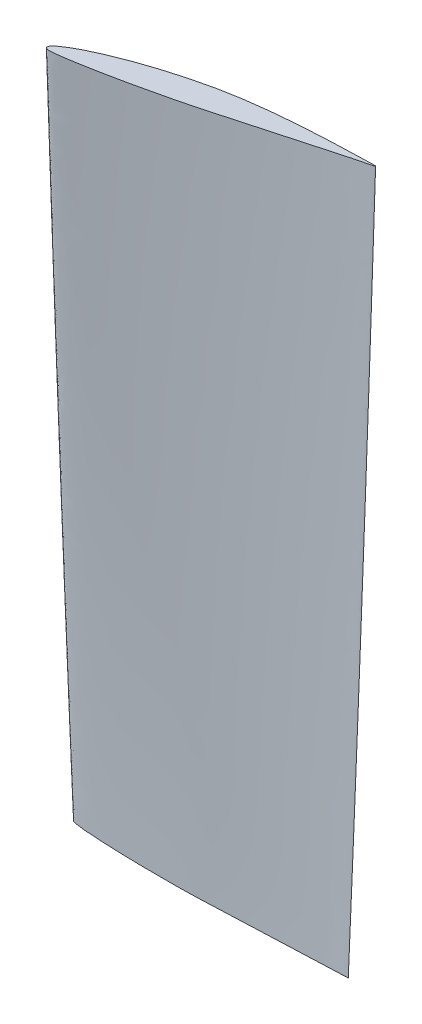
ISO-10303-21;
HEADER;
FILE_DESCRIPTION(('STEP AP214'),'2;1');
FILE_NAME('part.step','',(''),(''),'','','');
FILE_SCHEMA(('AUTOMOTIVE_DESIGN { 1 0 10303 214 1 1 1 1 }'));
ENDSEC;
DATA;
#1=APPLICATION_CONTEXT('core data for automotive mechanical design processes');
#2=APPLICATION_PROTOCOL_DEFINITION('international standard','automotive_design',2000,#1);
#3=PRODUCT_CONTEXT('',#1,'mechanical');
#4=PRODUCT('Part','Part','',(#3));
#5=PRODUCT_RELATED_PRODUCT_CATEGORY('part','',(#4));
#6=PRODUCT_DEFINITION_FORMATION('','',#4);
#7=PRODUCT_DEFINITION_CONTEXT('part definition',#1,'design');
#8=PRODUCT_DEFINITION('design','',#6,#7);
#9=PRODUCT_DEFINITION_SHAPE('','',#8);
#10=(LENGTH_UNIT() NAMED_UNIT(*) SI_UNIT(.MILLI.,.METRE.));
#11=(NAMED_UNIT(*) PLANE_ANGLE_UNIT() SI_UNIT($,.RADIAN.));
#12=(NAMED_UNIT(*) SI_UNIT($,.STERADIAN.) SOLID_ANGLE_UNIT());
#13=UNCERTAINTY_MEASURE_WITH_UNIT(LENGTH_MEASURE(1.E-05),#10,'distance_accuracy_value','');
#14=(GEOMETRIC_REPRESENTATION_CONTEXT(3) GLOBAL_UNCERTAINTY_ASSIGNED_CONTEXT((#13)) GLOBAL_UNIT_ASSIGNED_CONTEXT((#10,
#11,#12)) REPRESENTATION_CONTEXT('',''));
#15=CARTESIAN_POINT('',(0.,0.,0.));
#16=DIRECTION('',(0.,0.,1.));
#17=DIRECTION('',(1.,0.,0.));
#18=AXIS2_PLACEMENT_3D('',#15,#16,#17);
#19=CARTESIAN_POINT('',(1.3805770579935,250.,10.3773467622895));
#20=DIRECTION('',(0.,-1.,0.));
#21=DIRECTION('',(0.,0.,-1.));
#22=AXIS2_PLACEMENT_3D('',#19,#20,#21);
#23=PLANE('',#22);
#24=CARTESIAN_POINT('',(98.7185032392619,250.,-11.2475527171933));
#25=CARTESIAN_POINT('',(98.6953788844156,250.,-11.4674198865856));
#26=CARTESIAN_POINT('',(92.8678679630491,250.,-11.1115360947269));
#27=CARTESIAN_POINT('',(88.777346362227,250.,-11.0904412507259));
#28=CARTESIAN_POINT('',(83.4505807998771,250.,-10.8835788978399));
#29=CARTESIAN_POINT('',(78.4583445012597,250.,-10.657648513941));
#30=CARTESIAN_POINT('',(73.3812918968487,250.,-10.3577081864331));
#31=CARTESIAN_POINT('',(68.3359930297548,250.,-9.98005155257131));
#32=CARTESIAN_POINT('',(63.2961454667792,250.,-9.50730267157987));
#33=CARTESIAN_POINT('',(58.2732160757085,250.,-8.93349321352211));
#34=CARTESIAN_POINT('',(53.2705215873069,250.,-8.23671932375472));
#35=CARTESIAN_POINT('',(48.2928989491604,250.,-7.40598210229374));
#36=CARTESIAN_POINT('',(43.3518883844483,250.,-6.39425757155135));
#37=CARTESIAN_POINT('',(38.4447225699898,250.,-5.23283048368049));
#38=CARTESIAN_POINT('',(33.5722559842998,250.,-3.92414031231968));
#39=CARTESIAN_POINT('',(28.7302394994752,250.,-2.48928550463781));
#40=CARTESIAN_POINT('',(23.9213516357504,250.,-0.919586755806925));
#41=CARTESIAN_POINT('',(19.1532484242936,250.,0.806135306103299));
#42=CARTESIAN_POINT('',(14.4256361965593,250.,2.69544414861182));
#43=CARTESIAN_POINT('',(9.7577484378379,250.,4.8118161564165));
#44=CARTESIAN_POINT('',(5.93251486856547,250.,6.8136635065412));
#45=CARTESIAN_POINT('',(3.37358335020474,250.,8.49719140412062));
#46=CARTESIAN_POINT('',(2.15843919850955,250.,9.4274542547956));
#47=CARTESIAN_POINT('',(1.64168080355027,250.,9.98445315947287));
#48=CARTESIAN_POINT('',(1.28714635955408,250.,10.4681885266902));
#49=CARTESIAN_POINT('',(1.04866108609731,250.,11.3564177593959));
#50=CARTESIAN_POINT('',(1.86902221586287,250.,11.6903929488291));
#51=CARTESIAN_POINT('',(2.43180440329608,250.,11.7761861058592));
#52=CARTESIAN_POINT('',(3.14727005846457,250.,11.7962798863664));
#53=CARTESIAN_POINT('',(4.59807468140329,250.,11.6651044806619));
#54=CARTESIAN_POINT('',(6.70334177751044,250.,11.4177794803758));
#55=CARTESIAN_POINT('',(9.19683425874322,250.,11.0401784269643));
#56=CARTESIAN_POINT('',(12.4927045028018,250.,10.5016380791467));
#57=CARTESIAN_POINT('',(16.5840460743525,250.,9.75004565848596));
#58=CARTESIAN_POINT('',(21.4731950943981,250.,8.79949133724684));
#59=CARTESIAN_POINT('',(26.340803898449,250.,7.79073457032793));
#60=CARTESIAN_POINT('',(32.8083941542606,250.,6.38726843972808));
#61=CARTESIAN_POINT('',(39.2544423920881,250.,4.90043931768262));
#62=CARTESIAN_POINT('',(45.671800447249,250.,3.29691374857312));
#63=CARTESIAN_POINT('',(50.4678305768782,250.,2.01488851530614));
#64=CARTESIAN_POINT('',(55.2454922805691,250.,0.650265392383001));
#65=CARTESIAN_POINT('',(60.0469589655842,250.,-0.650156143971818));
#66=CARTESIAN_POINT('',(64.8491935947142,250.,-1.96993259698825));
#67=CARTESIAN_POINT('',(69.6622741293406,250.,-3.28705207961921));
#68=CARTESIAN_POINT('',(74.4774574521564,250.,-4.60731165872313));
#69=CARTESIAN_POINT('',(79.3257560237012,250.,-5.93278351123687));
#70=CARTESIAN_POINT('',(84.0966464977638,250.,-7.24930093162982));
#71=CARTESIAN_POINT('',(89.2050016643206,250.,-8.61345368170239));
#72=CARTESIAN_POINT('',(93.0955760373238,250.,-9.81112698428557));
#73=CARTESIAN_POINT('',(98.7414285480837,250.,-11.0295780843183));
#74=CARTESIAN_POINT('',(98.7185032392619,250.,-11.2475527171933));
#75=B_SPLINE_CURVE_WITH_KNOTS('',3,(#24,#25,#26,#27,#28,#29,#30,#31,#32,#33,#34,#35,#36,#37,#38,
#39,#40,#41,#42,#43,#44,#45,#46,#47,#48,#49,#50,#51,#52,#53,#54,#55,#56,#57,#58,#59,#60,#61,#62,
#63,#64,#65,#66,#67,#68,#69,#70,#71,#72,#73,#74),.UNSPECIFIED.,.T.,.F.,(4,1,1,1,1,1,1,1,1,1,1,1,
1,1,1,1,1,1,1,1,1,1,1,1,1,1,1,1,1,1,1,1,1,1,1,1,1,1,1,1,1,1,1,1,1,1,1,1,4),(0.,
0.0250985823143505,0.0501102651365007,0.0751313077305293,0.10015501620287,0.125174391903254,
0.150179897380279,0.175165340764159,0.200126741883972,0.225061402286283,0.249970697015837,
0.274860954861571,0.299750113325657,0.324651991921063,0.349578989932098,0.374544121310994,
0.399567120680289,0.424675858874537,0.449929566713216,0.47546938215653,0.488517266620249,
0.495250708141096,0.498114923086601,0.499655715563157,0.504316974056221,0.508819964114899,
0.510252538561018,0.512928359216266,0.51931609567503,0.53186485010328,0.544297352213037,
0.556673811558412,0.581327184488078,0.605908227729714,0.630446072939404,0.654955385461452,
0.703934138376655,0.728422341063454,0.752927701720366,0.777462008694063,0.802016939064616,
0.826605968652421,0.851234504013439,0.875909018308074,0.900632924813173,0.925408730120536,
0.950238387530321,0.975117457141173,1.),.UNSPECIFIED.);
#76=CARTESIAN_POINT('',(98.7185032392619,250.,-11.2475527171933));
#77=VERTEX_POINT('',#76);
#78=EDGE_CURVE('E11',#77,#77,#75,.T.);
#79=ORIENTED_EDGE('',*,*,#78,.T.);
#80=EDGE_LOOP('',(#79));
#81=FACE_BOUND('',#80,.T.);
#82=ADVANCED_FACE('F246',(#81),#23,.F.);
#83=CARTESIAN_POINT('',(0.292353775907828,0.,-0.825684247843291));
#84=DIRECTION('',(0.,-1.,0.));
#85=DIRECTION('',(0.,0.,-1.));
#86=AXIS2_PLACEMENT_3D('',#83,#84,#85);
#87=PLANE('',#86);
#88=CARTESIAN_POINT('',(100.,0.,0.));
#89=CARTESIAN_POINT('',(100.026927671132,0.,-0.219433857601069));
#90=CARTESIAN_POINT('',(94.2687190448548,0.,-1.18357603877328));
#91=CARTESIAN_POINT('',(90.27829193949,0.,-2.08318901378913));
#92=CARTESIAN_POINT('',(85.041517129227,0.,-3.0798900557229));
#93=CARTESIAN_POINT('',(80.1264082453985,0.,-3.98275907273884));
#94=CARTESIAN_POINT('',(75.1120082774222,0.,-4.83259453247245));
#95=CARTESIAN_POINT('',(70.1110658354599,0.,-5.59956251336753));
#96=CARTESIAN_POINT('',(65.0940438797978,0.,-6.27264917857509));
#97=CARTESIAN_POINT('',(60.0707728010258,0.,-6.84345968217377));
#98=CARTESIAN_POINT('',(55.0395570271188,0.,-7.28990546178536));
#99=CARTESIAN_POINT('',(50.0026353208612,0.,-7.60018144206824));
#100=CARTESIAN_POINT('',(44.960674036922,0.,-7.72587288156002));
#101=CARTESIAN_POINT('',(39.9180143164162,0.,-7.69808521851062));
#102=CARTESIAN_POINT('',(34.8760374997964,0.,-7.51900318716417));
#103=CARTESIAN_POINT('',(29.8353494819684,0.,-7.21014032865745));
#104=CARTESIAN_POINT('',(24.7966077140941,0.,-6.76243725223213));
#105=CARTESIAN_POINT('',(19.7625076817131,0.,-6.15353517960491));
#106=CARTESIAN_POINT('',(14.7310618329927,0.,-5.37613055548834));
#107=CARTESIAN_POINT('',(9.70673162057761,0.,-4.36404729801728));
#108=CARTESIAN_POINT('',(5.52922086782098,0.,-3.27399749030539));
#109=CARTESIAN_POINT('',(2.65716322291704,0.,-2.20925264672238));
#110=CARTESIAN_POINT('',(1.26389952803014,0.,-1.57618033074622));
#111=CARTESIAN_POINT('',(0.635088126379815,0.,-1.14970261769804));
#112=CARTESIAN_POINT('',(0.180823596335742,0.,-0.758118253580851));
#113=CARTESIAN_POINT('',(-0.251357417409344,0.,0.0536982077151383));
#114=CARTESIAN_POINT('',(0.472849838761527,0.,0.56365473579568));
#115=CARTESIAN_POINT('',(1.0019086940586,0.,0.773847466142885));
#116=CARTESIAN_POINT('',(1.69451689374877,0.,0.954370998278406));
#117=CARTESIAN_POINT('',(3.13764553369679,0.,1.15291763324959));
#118=CARTESIAN_POINT('',(5.24459079259244,0.,1.38551365784962));
#119=CARTESIAN_POINT('',(7.75911696803286,0.,1.57850406170493));
#120=CARTESIAN_POINT('',(11.0916595399467,0.,1.79517691489934));
#121=CARTESIAN_POINT('',(15.2472114236061,0.,1.98319208588349));
#122=CARTESIAN_POINT('',(20.224881617593,0.,2.15684962290712));
#123=CARTESIAN_POINT('',(25.194649087253,0.,2.26881001014293));
#124=CARTESIAN_POINT('',(31.8122150760427,0.,2.35675664141578));
#125=CARTESIAN_POINT('',(38.4273418798502,0.,2.35472498491023));
#126=CARTESIAN_POINT('',(46.6975695156845,0.,2.21593206805948));
#127=CARTESIAN_POINT('',(53.3119366539603,0.,1.88296974154405));
#128=CARTESIAN_POINT('',(59.9356266936685,0.,1.62522224566525));
#129=CARTESIAN_POINT('',(64.9117703433052,0.,1.42126340895399));
#130=CARTESIAN_POINT('',(69.8977511827702,0.,1.22014608270236));
#131=CARTESIAN_POINT('',(74.8865230218986,0.,1.01702965608465));
#132=CARTESIAN_POINT('',(79.9087242718411,0.,0.816125999301941));
#133=CARTESIAN_POINT('',(84.8534896606435,0.,0.606576665018987));
#134=CARTESIAN_POINT('',(90.1377854676766,0.,0.42651452627273));
#135=CARTESIAN_POINT('',(94.198062583209,0.,0.134726969093299));
#136=CARTESIAN_POINT('',(99.9733041124539,0.,0.217545050873831));
#137=CARTESIAN_POINT('',(100.,0.,0.));
#138=B_SPLINE_CURVE_WITH_KNOTS('',3,(#88,#89,#90,#91,#92,#93,#94,#95,#96,#97,#98,#99,#100,#101,
#102,#103,#104,#105,#106,#107,#108,#109,#110,#111,#112,#113,#114,#115,#116,#117,#118,#119,#120,
#121,#122,#123,#124,#125,#126,#127,#128,#129,#130,#131,#132,#133,#134,#135,#136,#137),
.UNSPECIFIED.,.T.,.F.,(4,1,1,1,1,1,1,1,1,1,1,1,1,1,1,1,1,1,1,1,1,1,1,1,1,1,1,1,1,1,1,1,1,1,1,1,
1,1,1,1,1,1,1,1,1,1,1,4),(0.,0.0250986036707922,0.0501103077754415,0.0751313716599333,
0.100155101425005,0.125174498414434,0.150180025168701,0.175165489812754,0.200126912172281,
0.225061593791551,0.249970909716482,0.274861188741394,0.299750368383722,0.324652268168195,
0.34957928738967,0.374544440011454,0.399567460672877,0.424676220232209,0.449929949559326,
0.475469786734528,0.488517682300722,0.49525112955107,0.498115346933742,0.499656140721362,
0.504317403180702,0.508820397070985,0.510252972736085,0.512928795668195,0.519316537562298,
0.531865302668312,0.544297815356915,0.556674285233447,0.581327679140725,0.605908743298428,
0.630446609387428,0.654955942764506,0.703934737355844,0.728422960879711,0.777461819335971,
0.802016770600371,0.826605821111039,0.851234377428534,0.87590891271877,0.900632840261498,
0.925408666650652,0.95023834518805,0.97511743596856,1.),.UNSPECIFIED.);
#139=CARTESIAN_POINT('',(100.,0.,0.));
#140=VERTEX_POINT('',#139);
#141=EDGE_CURVE('E256',#140,#140,#138,.T.);
#142=ORIENTED_EDGE('',*,*,#141,.F.);
#143=EDGE_LOOP('',(#142));
#144=FACE_BOUND('',#143,.T.);
#145=ADVANCED_FACE('F284',(#144),#87,.T.);
#146=CARTESIAN_POINT('',(-2.51955949166066E-05,0.,-0.000104283701989457));
#147=CARTESIAN_POINT('',(0.000401456215351173,41.6666897797039,1.89819284429965));
#148=CARTESIAN_POINT('',(0.214611258325032,125.000031203439,5.6714882808099));
#149=CARTESIAN_POINT('',(0.855534365725499,208.33335644637,9.39818878240701));
#150=CARTESIAN_POINT('',(1.2826741686703,250.,11.249889623459));
#151=CARTESIAN_POINT('',(0.0582188688213574,0.,0.24108052290238));
#152=CARTESIAN_POINT('',(0.0676449403254082,41.6666871982451,2.13725136524158));
#153=CARTESIAN_POINT('',(0.299485027051525,125.000033784898,5.90524932819688));
#154=CARTESIAN_POINT('',(0.958791212513063,208.333353864912,9.62394113669178));
#155=CARTESIAN_POINT('',(1.39489317608215,250.,11.4711642256042));
#156=CARTESIAN_POINT('',(0.541449729970483,0.,0.631212843608661));
#157=CARTESIAN_POINT('',(0.565315685056332,41.6666771628017,2.50934528189483));
#158=CARTESIAN_POINT('',(0.824834787714547,125.000043820341,6.23911352055363));
#159=CARTESIAN_POINT('',(1.50723623934336,208.333343829468,9.91617213953607));
#160=CARTESIAN_POINT('',(1.95435149285757,250.,11.7414303679625));
#161=CARTESIAN_POINT('',(1.28468532153703,0.,0.858985619005208));
#162=CARTESIAN_POINT('',(1.31739580443783,41.6666710953075,2.70901537827464));
#163=CARTESIAN_POINT('',(1.59080585266041,125.000049887836,6.3818195778029));
#164=CARTESIAN_POINT('',(2.28037841210289,208.333337761974,10.0000288515002));
#165=CARTESIAN_POINT('',(2.72915362446774,250.,11.7955119279321));
#166=CARTESIAN_POINT('',(2.07101845822669,0.,1.00941797816759));
#167=CARTESIAN_POINT('',(2.10933250511696,41.6666698403652,2.82963371121339));
#168=CARTESIAN_POINT('',(2.3907434879654,125.000051142777,6.44244293911511));
#169=CARTESIAN_POINT('',(3.08166955428443,208.333336507032,10.0000206383283));
#170=CARTESIAN_POINT('',(3.52952553478887,250.,11.7649967345941));
#171=CARTESIAN_POINT('',(2.85140953821881,0.,1.10884236769737));
#172=CARTESIAN_POINT('',(2.89353964211613,41.6666689045196,2.89943696035185));
#173=CARTESIAN_POINT('',(3.17911118229855,125.000052078623,6.45293513603973));
#174=CARTESIAN_POINT('',(3.86731757826286,208.333335571187,9.95103769946814));
#175=CARTESIAN_POINT('',(4.31207603976192,250.000000000001,11.6862439142667));
#176=CARTESIAN_POINT('',(3.63809091526479,0.,1.20547076462186));
#177=CARTESIAN_POINT('',(3.68385651561651,41.6666689641777,2.96619132552729));
#178=CARTESIAN_POINT('',(3.97334660743761,125.000052018965,6.45990447635726));
#179=CARTESIAN_POINT('',(4.65874980722664,208.333335630844,9.89815527854354));
#180=CARTESIAN_POINT('',(5.10043096057696,249.999999999999,11.6034165768127));
#181=CARTESIAN_POINT('',(4.42396370016274,0.,1.29120110756907));
#182=CARTESIAN_POINT('',(4.47298724372015,41.6666685799478,3.02208438519435));
#183=CARTESIAN_POINT('',(4.76558223711161,125.000052403195,6.45612412581754));
#184=CARTESIAN_POINT('',(5.44727286233968,208.333335246615,9.83470189634111));
#185=CARTESIAN_POINT('',(5.88539209918113,250.000000000001,11.5101274057286));
#186=CARTESIAN_POINT('',(5.21216492173492,0.,1.36987922338399));
#187=CARTESIAN_POINT('',(5.26416001399799,41.6666684351197,3.07083366393059));
#188=CARTESIAN_POINT('',(5.55931389993006,125.000052548023,6.44505285006486));
#189=CARTESIAN_POINT('',(6.23679378865447,208.333335101786,9.76388487952865));
#190=CARTESIAN_POINT('',(6.6711155914663,250.,11.4094560383569));
#191=CARTESIAN_POINT('',(5.99976722736026,0.,1.43955041832809));
#192=CARTESIAN_POINT('',(6.05440204986629,41.6666681919832,3.11059994502599));
#193=CARTESIAN_POINT('',(6.35144031995725,125.00005279116,6.42508294593123));
#194=CARTESIAN_POINT('',(7.02401475126803,208.33333485865,9.68432596516845));
#195=CARTESIAN_POINT('',(7.45418627738718,250.000000000001,11.300139450799));
#196=CARTESIAN_POINT('',(6.78919694507317,0.,1.50298614679776));
#197=CARTESIAN_POINT('',(6.84622927979099,41.6666680645055,3.14405914498037));
#198=CARTESIAN_POINT('',(7.14467158839656,125.000052918637,6.39869410634288));
#199=CARTESIAN_POINT('',(7.81186799534196,208.333334731172,9.5982992409289));
#200=CARTESIAN_POINT('',(8.23765501895576,250.,11.1843462901158));
#201=CARTESIAN_POINT('',(7.57691958993988,0.,1.56112834723359));
#202=CARTESIAN_POINT('',(7.63615083376255,41.6666679638353,3.17228860730008));
#203=CARTESIAN_POINT('',(7.93560678537008,125.000053019308,6.36722664242988));
#204=CARTESIAN_POINT('',(8.59704850693067,208.333334630502,9.50739203855353));
#205=CARTESIAN_POINT('',(9.01826609954328,250.,11.0637834942756));
#206=CARTESIAN_POINT('',(8.36834296850106,0.,1.61638480383098));
#207=CARTESIAN_POINT('',(8.42966166195301,41.6666679131469,3.19749051856543));
#208=CARTESIAN_POINT('',(8.72989508961186,125.000053069995,6.33246455210499));
#209=CARTESIAN_POINT('',(9.38531943746179,208.333334579813,9.41295624953428));
#210=CARTESIAN_POINT('',(9.80182963180321,250.,10.9395834002419));
#211=CARTESIAN_POINT('',(9.41597931664972,0.,1.68570757091925));
#212=CARTESIAN_POINT('',(9.47991842105179,41.6666678284588,3.22702960559939));
#213=CARTESIAN_POINT('',(9.78089842332159,125.000053154684,6.28264298308146));
#214=CARTESIAN_POINT('',(10.4280808565401,208.333334495126,9.28418758668964));
#215=CARTESIAN_POINT('',(10.8382229698596,250.000000000001,10.7714445425791));
#216=CARTESIAN_POINT('',(10.7380343618963,0.,1.76506491256412));
#217=CARTESIAN_POINT('',(10.804958340284,41.6666677299305,3.25618359622217));
#218=CARTESIAN_POINT('',(11.1062480953054,125.000053253212,6.21168541244406));
#219=CARTESIAN_POINT('',(11.7424202962043,208.333334396597,9.11370893820085));
#220=CARTESIAN_POINT('',(12.1442272957843,250.,10.5513529255238));
#221=CARTESIAN_POINT('',(12.3149888028913,0.,1.84709642720633));
#222=CARTESIAN_POINT('',(12.3850376074151,41.6666675780448,3.27832898183611));
#223=CARTESIAN_POINT('',(12.6857922207754,125.000053405098,6.11446789385949));
#224=CARTESIAN_POINT('',(13.3078597003891,208.333334244712,8.89794745425987));
#225=CARTESIAN_POINT('',(13.6992219423504,250.,10.2765241358442));
#226=CARTESIAN_POINT('',(13.8973035992792,0.,1.91957011779978));
#227=CARTESIAN_POINT('',(13.9700309502361,41.6666675870775,3.29071813942316));
#228=CARTESIAN_POINT('',(14.2694215749814,125.000053396065,6.0071364932038));
#229=CARTESIAN_POINT('',(14.8766829234869,208.333334253744,8.67179280910488));
#230=CARTESIAN_POINT('',(15.257281559156,250.,9.99118212232178));
#231=CARTESIAN_POINT('',(15.4777413992967,0.,1.98460876716955));
#232=CARTESIAN_POINT('',(15.553015723971,41.6666674321535,3.29572896459641));
#233=CARTESIAN_POINT('',(15.850640399691,125.000053550989,5.89258593706641));
#234=CARTESIAN_POINT('',(16.4424160178311,208.33333409882,8.43866964482115));
#235=CARTESIAN_POINT('',(16.8118418400867,250.,9.69901978750683));
#236=CARTESIAN_POINT('',(17.0588753929662,0.,2.04463954050226));
#237=CARTESIAN_POINT('',(17.1362278685139,41.6666676952357,3.29572657024511));
#238=CARTESIAN_POINT('',(17.4314274409348,125.000053287907,5.77301178370985));
#239=CARTESIAN_POINT('',(18.0076151845212,208.333334361902,8.20051327351741));
#240=CARTESIAN_POINT('',(18.3659563669773,250.,9.40181959541067));
#241=CARTESIAN_POINT('',(18.6411585585293,0.,2.09904421598938));
#242=CARTESIAN_POINT('',(18.720880650872,41.6666672366116,3.290013493791));
#243=CARTESIAN_POINT('',(19.0137292243276,125.000053746531,5.64762354473195));
#244=CARTESIAN_POINT('',(19.573385498961,208.333333903278,7.95657069424089));
#245=CARTESIAN_POINT('',(19.9199158306629,250.,9.09888001666423));
#246=CARTESIAN_POINT('',(20.220683771852,0.,2.1475365230198));
#247=CARTESIAN_POINT('',(20.3017265400979,41.6666678677899,3.27856833198186));
#248=CARTESIAN_POINT('',(20.5909690992919,125.000053115353,5.51681341670292));
#249=CARTESIAN_POINT('',(21.1345246907216,208.333334534457,7.70741604974429));
#250=CARTESIAN_POINT('',(21.4698809977876,250.,8.79080809966344));
#251=CARTESIAN_POINT('',(22.3371429445096,0.,2.20411473110356));
#252=CARTESIAN_POINT('',(22.4198748306121,41.6666682550874,3.25482541010561));
#253=CARTESIAN_POINT('',(22.7038812282541,125.000052728055,5.33315945583949));
#254=CARTESIAN_POINT('',(23.2249719188256,208.333334921754,7.36531398327449));
#255=CARTESIAN_POINT('',(23.5447885768298,250.,8.36984759085689));
#256=CARTESIAN_POINT('',(24.9629071162843,0.,2.26010093291833));
#257=CARTESIAN_POINT('',(25.0489878941343,41.6666666020439,3.21099358019583));
#258=CARTESIAN_POINT('',(25.3272363322907,125.000054381099,5.09082669926141));
#259=CARTESIAN_POINT('',(25.8176575298054,208.333333268711,6.92675060630179));
#260=CARTESIAN_POINT('',(26.1159115697911,250.,7.83373647207726));
#261=CARTESIAN_POINT('',(28.1348372003119,0.,2.3088479504946));
#262=CARTESIAN_POINT('',(28.2219187443021,41.6666683637595,3.13924515479997));
#263=CARTESIAN_POINT('',(28.4894287830309,125.000052619383,4.77941429269916));
#264=CARTESIAN_POINT('',(28.9436318716175,208.333335030426,6.37832907266441));
#265=CARTESIAN_POINT('',(29.2174068912851,250.,7.16747382729125));
#266=CARTESIAN_POINT('',(31.2956139683364,0.,2.3391676766628));
#267=CARTESIAN_POINT('',(31.3842029855711,41.6666670256286,3.04961374582114));
#268=CARTESIAN_POINT('',(31.640869847574,125.000053957514,4.45123440030477));
#269=CARTESIAN_POINT('',(32.0565135028485,208.333333692295,5.81430852848654));
#270=CARTESIAN_POINT('',(32.3040797442526,250.,6.48620985066092));
#271=CARTESIAN_POINT('',(34.4621443881917,0.,2.35085830796182));
#272=CARTESIAN_POINT('',(34.5510124622092,41.6666652665027,2.94150275869678));
#273=CARTESIAN_POINT('',(34.7949086835674,125.00005571664,4.10468902688869));
#274=CARTESIAN_POINT('',(35.1711241793326,208.33333193317,5.2316668004227));
#275=CARTESIAN_POINT('',(35.3923119638768,250.,5.78610437055069));
#276=CARTESIAN_POINT('',(37.6258760965335,0.,2.34260111444425));
#277=CARTESIAN_POINT('',(37.7145022018441,41.6666653394059,2.81319043855306));
#278=CARTESIAN_POINT('',(37.9443415605685,125.000055643737,3.73777140710579));
#279=CARTESIAN_POINT('',(38.2793544269417,208.333332006073,4.62915449106399));
#280=CARTESIAN_POINT('',(38.4731544341797,250.,5.06654719321066));
#281=CARTESIAN_POINT('',(40.7911313048668,0.,2.31304346243527));
#282=CARTESIAN_POINT('',(40.8784632463114,41.6666682568624,2.66284339652296));
#283=CARTESIAN_POINT('',(41.092325186916,125.00005272628,3.34789474669336));
#284=CARTESIAN_POINT('',(41.3845826479406,208.333334923529,4.00384751804973));
#285=CARTESIAN_POINT('',(41.5503104073107,250.,4.32454964472543));
#286=CARTESIAN_POINT('',(43.9552717571809,0.,2.26047055529767));
#287=CARTESIAN_POINT('',(44.0403774310048,41.6666704045672,2.48845618172894));
#288=CARTESIAN_POINT('',(44.2363709079767,125.000050578576,2.93275153725326));
#289=CARTESIAN_POINT('',(44.4839281777794,208.333337071234,3.35369415368837));
#290=CARTESIAN_POINT('',(44.6205978773428,250.,3.55832751323683));
#291=CARTESIAN_POINT('',(47.1185337426744,0.,2.16397875802407));
#292=CARTESIAN_POINT('',(47.2004820250068,41.6666631902018,2.27617719599865));
#293=CARTESIAN_POINT('',(47.3765893131306,125.000057792941,2.48789221946835));
#294=CARTESIAN_POINT('',(47.5771174594205,208.333329856868,2.67424289499006));
#295=CARTESIAN_POINT('',(47.683486894295,250.,2.7610773065112));
#296=CARTESIAN_POINT('',(50.2804889868264,0.,2.03388184371864));
#297=CARTESIAN_POINT('',(50.3580177399144,41.6666685970916,2.0304842825956));
#298=CARTESIAN_POINT('',(50.5117259235323,125.000052386051,2.01004915232357));
#299=CARTESIAN_POINT('',(50.6627351206096,208.333335263758,1.96233417143407));
#300=CARTESIAN_POINT('',(50.7375650578693,250.,1.93165667697635));
#301=CARTESIAN_POINT('',(53.442162195547,0.,1.88992239161091));
#302=CARTESIAN_POINT('',(53.5133743501431,41.6666711951815,1.76059215836678));
#303=CARTESIAN_POINT('',(53.6413050400674,125.000049787961,1.49441152994346));
#304=CARTESIAN_POINT('',(53.7402482621318,208.333337861848,1.21319106451165));
#305=CARTESIAN_POINT('',(53.7824730635301,250.,1.06882075082823));
#306=CARTESIAN_POINT('',(56.6040064610802,0.,1.75461706442423));
#307=CARTESIAN_POINT('',(56.6696502631336,41.6666647741812,1.50248245490318));
#308=CARTESIAN_POINT('',(56.7731716941525,125.000056208962,0.994662285888943));
#309=CARTESIAN_POINT('',(56.8211605570241,208.333331440848,0.479741665917784));
#310=CARTESIAN_POINT('',(56.8312719019158,250.,0.220505880946137));
#311=CARTESIAN_POINT('',(59.7663851104415,0.,1.63121652012625));
#312=CARTESIAN_POINT('',(59.8275492644932,41.6666683931574,1.26073405353277));
#313=CARTESIAN_POINT('',(59.9086257920993,125.000052589985,0.517091251361327));
#314=CARTESIAN_POINT('',(59.9071986719043,208.333335059824,-0.231905482498988));
#315=CARTESIAN_POINT('',(59.8858592215582,250.,-0.607742783921389));
#316=CARTESIAN_POINT('',(62.9281100332349,0.,1.50254608340584));
#317=CARTESIAN_POINT('',(62.9843286668888,41.6666689860942,1.01190115703378));
#318=CARTESIAN_POINT('',(63.042119477618,125.000051997049,0.0300757269771549));
#319=CARTESIAN_POINT('',(62.9906173652795,208.333335652761,-0.952818642439665));
#320=CARTESIAN_POINT('',(62.9375430808208,250.,-1.44453361580434));
#321=CARTESIAN_POINT('',(66.0907202091517,0.,1.37377736281794));
#322=CARTESIAN_POINT('',(66.1419658724725,41.6666675257917,0.762718156329696));
#323=CARTESIAN_POINT('',(66.1764183709984,125.00005345735,-0.457642935014893));
#324=CARTESIAN_POINT('',(66.074793296044,208.333334192458,-1.67448636095113));
#325=CARTESIAN_POINT('',(65.989961344509,250.,-2.2820294131033));
#326=CARTESIAN_POINT('',(69.2528600436361,0.,1.24605965652981));
#327=CARTESIAN_POINT('',(69.2992305623036,41.6666682305496,0.515048332097019));
#328=CARTESIAN_POINT('',(69.310524763619,125.000052752593,-0.943230573147125));
#329=CARTESIAN_POINT('',(69.1589254613965,208.333334897216,-2.39401851744739));
#330=CARTESIAN_POINT('',(69.0424023922755,250.,-3.1175406177868));
#331=CARTESIAN_POINT('',(72.4138045286058,0.,1.1177375226656));
#332=CARTESIAN_POINT('',(72.455262138807,41.6666684132894,0.266691118487308));
#333=CARTESIAN_POINT('',(72.4433304753617,125.000052569853,-1.4295825348427));
#334=CARTESIAN_POINT('',(72.2417052954961,208.333335079956,-3.11421389763943));
#335=CARTESIAN_POINT('',(72.0934692636393,250.,-3.9536200015245));
#336=CARTESIAN_POINT('',(75.5748508731499,0.,0.989539755514163));
#337=CARTESIAN_POINT('',(75.6113906390409,41.6666682961185,0.01842282834708));
#338=CARTESIAN_POINT('',(75.5762318398894,125.000052687024,-1.91589597545087));
#339=CARTESIAN_POINT('',(75.3245967190758,208.333334962785,-3.8343801077591));
#340=CARTESIAN_POINT('',(75.1446599932022,250.,-4.78966464864511));
#341=CARTESIAN_POINT('',(78.7509218250821,0.,0.862458711102456));
#342=CARTESIAN_POINT('',(78.7825966934219,41.6666684120168,-0.229268079095317));
#343=CARTESIAN_POINT('',(78.7242408361776,125.000052571126,-2.40272841079642));
#344=CARTESIAN_POINT('',(78.4224742155821,208.333335078684,-4.55619714637446));
#345=CARTESIAN_POINT('',(78.2107381083224,250.,-5.62793488981627));
#346=CARTESIAN_POINT('',(81.8815371134103,0.,0.732076015196216));
#347=CARTESIAN_POINT('',(81.9082273142622,41.666668534811,-0.47853752318933));
#348=CARTESIAN_POINT('',(81.8266207553519,125.000052448331,-2.88769891007998));
#349=CARTESIAN_POINT('',(81.475040781726,208.333335201478,-5.27272331188015));
#350=CARTESIAN_POINT('',(81.2317573146058,250.,-6.45920266784002));
#351=CARTESIAN_POINT('',(85.0517951346149,0.,0.603357244421873));
#352=CARTESIAN_POINT('',(85.0735334264153,41.6666685460604,-0.727653176833337));
#353=CARTESIAN_POINT('',(84.9686208414325,125.000052437083,-3.37552284224858));
#354=CARTESIAN_POINT('',(84.5669305112276,208.333335212727,-5.99508399903386));
#355=CARTESIAN_POINT('',(84.2918907618336,250.,-7.29778898887891));
#356=CARTESIAN_POINT('',(87.776558446695,0.,0.506537380688362));
#357=CARTESIAN_POINT('',(87.7945688855434,41.6666686446736,-0.927946624994094));
#358=CARTESIAN_POINT('',(87.6706693299769,125.000052338469,-3.78103511498098));
#359=CARTESIAN_POINT('',(87.2269295671451,208.33333531134,-6.60235797236122));
#360=CARTESIAN_POINT('',(86.9250994690978,250.,-8.00507964036232));
#361=CARTESIAN_POINT('',(89.8393085698629,0.,0.415583759529532));
#362=CARTESIAN_POINT('',(89.8539161941393,41.6666687308298,-1.09724511950243));
#363=CARTESIAN_POINT('',(89.7143402322635,125.000052252313,-4.10561824925528));
#364=CARTESIAN_POINT('',(89.2371825619238,208.333335397497,-7.07941521263978));
#365=CARTESIAN_POINT('',(88.9142081215397,250.,-8.55767138017648));
#366=CARTESIAN_POINT('',(91.2434626898887,0.,0.336539542717235));
#367=CARTESIAN_POINT('',(91.2550747775821,41.6666688192264,-1.22961525623248));
#368=CARTESIAN_POINT('',(91.1035251607105,125.000052163917,-4.34361936871221));
#369=CARTESIAN_POINT('',(90.6024287089747,208.333335485893,-7.42100539877843));
#370=CARTESIAN_POINT('',(90.2644935869775,250.,-8.95054567110171));
#371=CARTESIAN_POINT('',(92.7138384780695,0.,0.261432680513303));
#372=CARTESIAN_POINT('',(92.7225256387303,41.6666687623073,-1.36055728663698));
#373=CARTESIAN_POINT('',(92.5589898385983,125.000052220835,-4.58520722949361));
#374=CARTESIAN_POINT('',(92.0336345895845,208.333335428974,-7.77118980019909));
#375=CARTESIAN_POINT('',(91.6805019043507,250.,-9.35451608982986));
#376=CARTESIAN_POINT('',(94.3706946805016,0.,0.205427646657972));
#377=CARTESIAN_POINT('',(94.3770760716521,41.666668639063,-1.47946733254022));
#378=CARTESIAN_POINT('',(94.2021623906786,125.00005234408,-4.82891695391574));
#379=CARTESIAN_POINT('',(93.6518966252867,208.333335305729,-8.1376781690036));
#380=CARTESIAN_POINT('',(93.2829255109537,250.,-9.78188860803711));
#381=CARTESIAN_POINT('',(96.5228356130304,0.,0.191252683788726));
#382=CARTESIAN_POINT('',(96.5284706347203,41.6666684201707,-1.5753572436729));
#383=CARTESIAN_POINT('',(96.3432064102329,125.000052562972,-5.08716495175996));
#384=CARTESIAN_POINT('',(95.7648745490682,208.333335086837,-8.55614014698846));
#385=CARTESIAN_POINT('',(95.377441484552,250.,-10.2799216711846));
#386=CARTESIAN_POINT('',(98.2904429701744,0.,0.1808663332899));
#387=CARTESIAN_POINT('',(98.2958128543419,41.6666687374929,-1.65288589172169));
#388=CARTESIAN_POINT('',(98.1022410824831,125.00005224565,-5.29804922335792));
#389=CARTESIAN_POINT('',(97.5000471492231,208.333335404159,-8.89852195110121));
#390=CARTESIAN_POINT('',(97.096794412496,250.,-10.6875877557794));
#391=CARTESIAN_POINT('',(99.3584312952391,0.,0.137709186899811));
#392=CARTESIAN_POINT('',(99.3624089946861,41.6666691093673,-1.73662895356676));
#393=CARTESIAN_POINT('',(99.1610896009842,125.000051873775,-5.46220967994056));
#394=CARTESIAN_POINT('',(98.5412215483375,208.333335776034,-9.14159094556866));
#395=CARTESIAN_POINT('',(98.1266501257162,250.,-10.969733801103));
#396=CARTESIAN_POINT('',(99.8867505728403,0.,0.0825983861277662));
#397=CARTESIAN_POINT('',(99.8888853373768,41.6666696011311,-1.81182665485402));
#398=CARTESIAN_POINT('',(99.681227126553,125.000051382012,-5.57704414153849));
#399=CARTESIAN_POINT('',(99.049714352764,208.333336267798,-9.29498826298344));
#400=CARTESIAN_POINT('',(98.6279940959212,250.,-11.1421440260664));
#401=CARTESIAN_POINT('',(100.07034918316,0.,-0.00424886876187006));
#402=CARTESIAN_POINT('',(100.069544304451,41.6666700447499,-1.90568556288126));
#403=CARTESIAN_POINT('',(99.854663228491,125.000050938393,-5.6843909361413));
#404=CARTESIAN_POINT('',(99.2132404236973,208.333336711416,-9.4147523172359));
#405=CARTESIAN_POINT('',(98.7858933620295,250.,-11.2678490002938));
#406=CARTESIAN_POINT('',(99.8273076598572,0.,-0.130446249049904));
#407=CARTESIAN_POINT('',(99.8220557675038,41.6666707883834,-2.02268179568925));
#408=CARTESIAN_POINT('',(99.5988038230387,125.00005019476,-5.78250563946374));
#409=CARTESIAN_POINT('',(98.9500564372322,208.33333745505,-9.49302746375293));
#410=CARTESIAN_POINT('',(98.51930866445,250.,-11.3359647511454));
#411=CARTESIAN_POINT('',(99.2628715904435,0.,-0.283679540463614));
#412=CARTESIAN_POINT('',(99.2520538600157,41.6666711679186,-2.15450446992361));
#413=CARTESIAN_POINT('',(99.01973634975,125.000049815224,-5.8710769354267));
#414=CARTESIAN_POINT('',(98.3660556085989,208.333337834585,-9.5374873832718));
#415=CARTESIAN_POINT('',(97.9338742133183,250.,-11.3581539104859));
#416=CARTESIAN_POINT('',(98.1625881592795,0.,-0.521311728680106));
#417=CARTESIAN_POINT('',(98.1429932193551,41.6666716055075,-2.35037265069749));
#418=CARTESIAN_POINT('',(97.8975322262074,125.000049377635,-5.98289183167511));
#419=CARTESIAN_POINT('',(97.2395298631711,208.333338272174,-9.56419885038031));
#420=CARTESIAN_POINT('',(96.8073931250035,250.,-11.3420510282043));
#421=CARTESIAN_POINT('',(96.3937032373534,0.,-0.845553752365536));
#422=CARTESIAN_POINT('',(96.3619535391902,41.6666718697752,-2.6074497239844));
#423=CARTESIAN_POINT('',(96.0996458201861,125.000049113367,-6.10508562513551));
#424=CARTESIAN_POINT('',(95.4397223125107,208.333338536442,-9.55040299169637));
#425=CARTESIAN_POINT('',(95.0103563973341,250.,-11.2599836539335));
#426=CARTESIAN_POINT('',(94.3161141940853,0.,-1.22396437882404));
#427=CARTESIAN_POINT('',(94.2698372425894,41.6666713798157,-2.90694006158813));
#428=CARTESIAN_POINT('',(93.9878139893053,125.000049603327,-6.24616104409605));
#429=CARTESIAN_POINT('',(93.3268529442792,208.333338046483,-9.53191486660985));
#430=CARTESIAN_POINT('',(92.90163774662,250.,-11.1614265863566));
#431=CARTESIAN_POINT('',(92.1514571938893,0.,-1.65840133664464));
#432=CARTESIAN_POINT('',(92.0884546343742,41.6666703693347,-3.25915042864951));
#433=CARTESIAN_POINT('',(91.7828377608559,125.000050613808,-6.43314766292939));
#434=CARTESIAN_POINT('',(91.1179983842389,208.333337036001,-9.55213646634857));
#435=CARTESIAN_POINT('',(90.6957728186864,250.,-11.0978803931932));
#436=CARTESIAN_POINT('',(89.9629227774759,0.,-2.13215343918044));
#437=CARTESIAN_POINT('',(89.8820666129348,41.6666708989753,-3.64978679227653));
#438=CARTESIAN_POINT('',(89.5501089608236,125.000050084167,-6.65658644702231));
#439=CARTESIAN_POINT('',(88.8776616665443,208.333337565642,-9.60644605560648));
#440=CARTESIAN_POINT('',(88.4563153578902,250.,-11.0671423341754));
#441=CARTESIAN_POINT('',(86.7900771909951,0.,-2.74839743666009));
#442=CARTESIAN_POINT('',(86.6859062586772,41.6666709202858,-4.14553943199088));
#443=CARTESIAN_POINT('',(86.3210511122676,125.000050062857,-6.9102500439885));
#444=CARTESIAN_POINT('',(85.6431704420933,208.333337586953,-9.61580844109199));
#445=CARTESIAN_POINT('',(85.2259734661194,250.,-10.9538009503118));
#446=CARTESIAN_POINT('',(83.6048007844798,0.,-3.34377800325171));
#447=CARTESIAN_POINT('',(83.4780378109966,41.6666708394642,-4.61994521740144));
#448=CARTESIAN_POINT('',(83.0818911453199,125.000050143678,-7.14171605586957));
#449=CARTESIAN_POINT('',(82.4005041230816,208.33333750613,-9.60235471531063));
#450=CARTESIAN_POINT('',(81.9885002526073,250.,-10.8173922501155));
#451=CARTESIAN_POINT('',(80.5320821815051,0.,-3.90387692001771));
#452=CARTESIAN_POINT('',(80.3840796113609,41.6666707064554,-5.06334983336579));
#453=CARTESIAN_POINT('',(79.9588260709692,125.000050276687,-7.35082805656887));
#454=CARTESIAN_POINT('',(79.2750768534533,208.333337373122,-9.57536650281145));
#455=CARTESIAN_POINT('',(78.8685780446439,250.,-10.6719019241862));
#456=CARTESIAN_POINT('',(77.4115400923205,0.,-4.44438158301049));
#457=CARTESIAN_POINT('',(77.2430653093871,41.6666707355836,-5.48534432470187));
#458=CARTESIAN_POINT('',(76.7903958113463,125.000050247559,-7.53500413876677));
#459=CARTESIAN_POINT('',(76.106287597818,208.333337402251,-9.52012853629855));
#460=CARTESIAN_POINT('',(75.7063735249668,250.,-10.4965579004055));
#461=CARTESIAN_POINT('',(74.2858149087637,0.,-4.95692561005801));
#462=CARTESIAN_POINT('',(74.0979107097011,41.6666706414093,-5.87918248723719));
#463=CARTESIAN_POINT('',(73.6199515580328,125.000050341733,-7.69075323713203));
#464=CARTESIAN_POINT('',(72.937692079657,208.333337308076,-9.43643435802141));
#465=CARTESIAN_POINT('',(72.5454869636976,250.,-10.2928034162343));
#466=CARTESIAN_POINT('',(71.1517380419542,0.,-5.43781420741364));
#467=CARTESIAN_POINT('',(70.9456150534418,41.6666706086446,-6.24104892238898));
#468=CARTESIAN_POINT('',(70.4447937614412,125.000050374498,-7.8140358822553));
#469=CARTESIAN_POINT('',(69.7668230415727,208.333337275311,-9.32005476143174));
#470=CARTESIAN_POINT('',(69.3835500241507,250.,-10.0563229659778));
#471=CARTESIAN_POINT('',(68.0343073971647,0.,-5.88041900310899));
#472=CARTESIAN_POINT('',(67.8114127227793,41.666670534135,-6.56526546085428));
#473=CARTESIAN_POINT('',(67.2905450251525,125.000050449008,-7.90108944024666));
#474=CARTESIAN_POINT('',(66.6195218516571,208.333337200802,-9.16917287781732));
#475=CARTESIAN_POINT('',(66.2464710904814,250.,-9.78628012855355));
#476=CARTESIAN_POINT('',(64.8685022662753,0.,-6.28983843730457));
#477=CARTESIAN_POINT('',(64.630107908939,41.6666705536319,-6.85445970506941));
#478=CARTESIAN_POINT('',(64.0919092307834,125.000050429511,-7.94961180333798));
#479=CARTESIAN_POINT('',(63.4308918533383,208.333337220299,-8.97658085439758));
#480=CARTESIAN_POINT('',(63.0696781828745,250.,-9.47302016129684));
#481=CARTESIAN_POINT('',(60.7376022818692,0.,-6.77204568379285));
#482=CARTESIAN_POINT('',(60.4809387072135,41.6666704596989,-7.17979400727497));
#483=CARTESIAN_POINT('',(59.9240450169859,125.000050523444,-7.96112941006921));
#484=CARTESIAN_POINT('',(59.2800194824891,208.333337126366,-8.67414078272198));
#485=CARTESIAN_POINT('',(58.9362234447823,250.,-9.01356584696334));
#486=CARTESIAN_POINT('',(55.4172083878921,0.,-7.27530746410027));
#487=CARTESIAN_POINT('',(55.1415062740845,41.6666704973746,-7.48101203683441));
#488=CARTESIAN_POINT('',(54.5694313703311,125.000050485768,-7.85867133693367));
#489=CARTESIAN_POINT('',(53.956016332526,208.333337164041,-8.16883024393432));
#490=CARTESIAN_POINT('',(53.6389734755544,250.,-8.30703477475014));
#491=CARTESIAN_POINT('',(49.1237903944755,0.,-7.65196502189431));
#492=CARTESIAN_POINT('',(48.8338787970736,41.6666706852536,-7.61869089083054));
#493=CARTESIAN_POINT('',(48.260347105957,125.00005029789,-7.5197876826156));
#494=CARTESIAN_POINT('',(47.6993995729352,208.33333735192,-7.35617484889342));
#495=CARTESIAN_POINT('',(47.4220715582679,250.,-7.25819095898864));
#496=CARTESIAN_POINT('',(43.861267144926,0.,-7.72941809445136));
#497=CARTESIAN_POINT('',(43.5684497300731,41.6666706868514,-7.49630551904109));
#498=CARTESIAN_POINT('',(43.0116136702688,125.000050296291,-6.99991952459301));
#499=CARTESIAN_POINT('',(42.5123762205713,208.333337353518,-6.44321291657489));
#500=CARTESIAN_POINT('',(42.2771568806733,250.,-6.14977919075207));
#501=CARTESIAN_POINT('',(39.6207615373552,0.,-7.67713435410049));
#502=CARTESIAN_POINT('',(39.3300094693194,41.6666710604357,-7.28300119700843));
#503=CARTESIAN_POINT('',(38.7952954747658,125.000049922707,-6.466818070526));
#504=CARTESIAN_POINT('',(38.354162726321,208.333337727102,-5.59480298859806));
#505=CARTESIAN_POINT('',(38.1569914228575,250.,-5.14483704148492));
#506=CARTESIAN_POINT('',(36.467448963947,0.,-7.57616685667796));
#507=CARTESIAN_POINT('',(36.1805581320845,41.6666711644095,-7.06229161444445));
#508=CARTESIAN_POINT('',(35.6669718185567,125.000049818732,-6.00856726749825));
#509=CARTESIAN_POINT('',(35.2737770936104,208.333337831076,-4.90289731275981));
#510=CARTESIAN_POINT('',(35.1072774062359,250.,-4.337075404151));
#511=CARTESIAN_POINT('',(33.3014371677105,0.,-7.42363441295681));
#512=CARTESIAN_POINT('',(33.0203847461284,41.666671392012,-6.78953657520186));
#513=CARTESIAN_POINT('',(32.5318769100683,125.000049591132,-5.49753334718693));
#514=CARTESIAN_POINT('',(32.1905638871587,208.333338058678,-4.15791755223366));
#515=CARTESIAN_POINT('',(32.0567058792559,250.,-3.47620587850451));
#516=CARTESIAN_POINT('',(30.1439874151837,0.,-7.21879692463861));
#517=CARTESIAN_POINT('',(29.8707515544721,41.6666716094753,-6.46480208771333));
#518=CARTESIAN_POINT('',(29.4112307998942,125.000049373666,-4.93539038020784));
#519=CARTESIAN_POINT('',(29.1256126847662,208.333338276142,-3.36313754710664));
#520=CARTESIAN_POINT('',(29.0262791106247,250.,-2.56630011372858));
#521=CARTESIAN_POINT('',(26.9922830054496,0.,-6.96076503509497));
#522=CARTESIAN_POINT('',(26.7288833935476,41.6666718467984,-6.08709168340679));
#523=CARTESIAN_POINT('',(26.3023395712228,125.000049136345,-4.32093291805154));
#524=CARTESIAN_POINT('',(26.0763071584109,208.333338513465,-2.51715335462685));
#525=CARTESIAN_POINT('',(26.0134186527447,250.,-1.60585754192505));
#526=CARTESIAN_POINT('',(24.3628037774851,0.,-6.69560174871823));
#527=CARTESIAN_POINT('',(24.1095110299729,41.6666721523462,-5.72208428466887));
#528=CARTESIAN_POINT('',(23.7142463612372,125.000048830796,-3.75862104267562));
#529=CARTESIAN_POINT('',(23.5416238606306,208.333338819013,-1.76230477280878));
#530=CARTESIAN_POINT('',(23.5109730234717,250.,-0.755932480928094));
#531=CARTESIAN_POINT('',(22.2715004407516,0.,-6.45279782138018));
#532=CARTESIAN_POINT('',(22.0274496275955,41.6666723379176,-5.39986911521965));
#533=CARTESIAN_POINT('',(21.659468439981,125.000048645225,-3.27961996812958));
#534=CARTESIAN_POINT('',(21.5317285733438,208.333339004584,-1.13059117455599));
#535=CARTESIAN_POINT('',(21.527918859374,250.,-0.0488809103846915));
#536=CARTESIAN_POINT('',(20.6993411340126,0.,-6.25422391977258));
#537=CARTESIAN_POINT('',(20.4628525631265,41.6666725370621,-5.14159905648884));
#538=CARTESIAN_POINT('',(20.1165941430465,125.00004844608,-2.90355355207744));
#539=CARTESIAN_POINT('',(20.023773552883,208.333339203729,-0.639920458694791));
#540=CARTESIAN_POINT('',(20.0407226186474,250.,0.498293976918487));
#541=CARTESIAN_POINT('',(19.1326600415313,0.,-6.04013286520557));
#542=CARTESIAN_POINT('',(18.9043195944999,41.6666727112165,-4.86801890207574));
#543=CARTESIAN_POINT('',(18.5809306780079,125.000048271926,-2.51265672828121));
#544=CARTESIAN_POINT('',(18.52412604654,208.333339377883,-0.135030170534966));
#545=CARTESIAN_POINT('',(18.5623697195915,250.,1.05935023210559));
#546=CARTESIAN_POINT('',(17.5662658132453,0.,-5.80911822622282));
#547=CARTESIAN_POINT('',(17.346717660729,41.6666729293199,-4.57752764233773));
#548=CARTESIAN_POINT('',(17.0474746070727,125.000048053822,-2.10494328302761));
#549=CARTESIAN_POINT('',(17.027938327643,208.333339595987,0.386443225393527));
#550=CARTESIAN_POINT('',(17.0880968136163,250.,1.63683807537405));
#551=CARTESIAN_POINT('',(16.0041899493912,0.,-5.55953932695898));
#552=CARTESIAN_POINT('',(15.794137617462,41.6666731634697,-4.26863665806481));
#553=CARTESIAN_POINT('',(15.5204226011342,125.000047819673,-1.67923567472499));
#554=CARTESIAN_POINT('',(15.5394870923162,208.333339830136,0.925352257065381));
#555=CARTESIAN_POINT('',(15.6222141616725,250.,2.23144404573632));
#556=CARTESIAN_POINT('',(14.444412019171,0.,-5.28930030284698));
#557=CARTESIAN_POINT('',(14.2446403349849,41.6666734350069,-3.93917406643227));
#558=CARTESIAN_POINT('',(13.9980027671121,125.000047548136,-1.23321864875935));
#559=CARTESIAN_POINT('',(14.0571769527913,208.333340101674,1.48413823012742));
#560=CARTESIAN_POINT('',(14.1632169458805,250.,2.84566814199256));
#561=CARTESIAN_POINT('',(12.8902570886004,0.,-4.99703025844743));
#562=CARTESIAN_POINT('',(12.7016019412863,41.6666737292034,-3.5878946910439));
#563=CARTESIAN_POINT('',(12.4836802506338,125.000047253939,-0.76590373208219));
#564=CARTESIAN_POINT('',(12.5845358604745,208.33334039587,2.06352238009306));
#565=CARTESIAN_POINT('',(12.7146579673827,250.,3.48009534825803));
#566=CARTESIAN_POINT('',(11.3381503633525,0.,-4.68046527387466));
#567=CARTESIAN_POINT('',(11.161534186566,41.6666740582878,-3.21239922237886));
#568=CARTESIAN_POINT('',(10.9741530046245,125.000046924855,-0.274631566402627));
#569=CARTESIAN_POINT('',(11.1184741985339,208.333340724954,2.66640265876216));
#570=CARTESIAN_POINT('',(11.2735603813043,250.,4.13773754783687));
#571=CARTESIAN_POINT('',(10.0523698320772,0.,-4.39624304829442));
#572=CARTESIAN_POINT('',(9.88656172537596,41.6666743571457,-2.87935921414487));
#573=CARTESIAN_POINT('',(9.72613934595317,125.000046625997,0.154224666845645));
#574=CARTESIAN_POINT('',(9.90810461792239,208.333341023812,3.18743642267672));
#575=CARTESIAN_POINT('',(10.0846841708968,250.,4.703950406938));
#576=CARTESIAN_POINT('',(9.02315449813128,0.,-4.15472561900793));
#577=CARTESIAN_POINT('',(8.86652855662514,41.666674614283,-2.59876558247363));
#578=CARTESIAN_POINT('',(8.72874242290093,125.00004636886,0.511455228370437));
#579=CARTESIAN_POINT('',(8.94188773242557,208.33334128095,3.61827296724966));
#580=CARTESIAN_POINT('',(9.13619326183198,250.,5.17083220557695));
#581=CARTESIAN_POINT('',(8.25497575343573,0.,-3.96609551547318));
#582=CARTESIAN_POINT('',(8.10552067349971,41.6666748568822,-2.38097159429413));
#583=CARTESIAN_POINT('',(7.98526117323302,125.00004612626,0.78641270345653));
#584=CARTESIAN_POINT('',(8.22230290854731,208.333341523549,3.94806539298582));
#585=CARTESIAN_POINT('',(8.43014910600695,250.,5.52745996544694));
#586=CARTESIAN_POINT('',(7.48813225884683,0.,-3.76797021249025));
#587=CARTESIAN_POINT('',(7.34620786960027,41.6666751328858,-2.15373405553685));
#588=CARTESIAN_POINT('',(7.24418566004127,125.000045850256,1.07067205718931));
#589=CARTESIAN_POINT('',(7.50581647725174,208.333341799552,4.28694129678151));
#590=CARTESIAN_POINT('',(7.72754517032475,250.,5.89304281598654));
#591=CARTESIAN_POINT('',(6.72482420716326,0.,-3.55944637860135));
#592=CARTESIAN_POINT('',(6.59082456341697,41.6666754460134,-1.9162332861995));
#593=CARTESIAN_POINT('',(6.50780909348717,125.00004553713,1.36488300721715));
#594=CARTESIAN_POINT('',(6.79476112145668,208.33334211268,4.63537511762139));
#595=CARTESIAN_POINT('',(7.03072904422022,250.,6.26796622713283));
#596=CARTESIAN_POINT('',(5.96466687964435,0.,-3.33902013159754));
#597=CARTESIAN_POINT('',(5.83904380684316,41.6666758088144,-1.6669511693582));
#598=CARTESIAN_POINT('',(5.77591981126522,125.000045174327,1.67058619858504));
#599=CARTESIAN_POINT('',(6.08903995366899,208.333342475481,4.99491815332513));
#600=CARTESIAN_POINT('',(6.33966109989285,250.,6.65378385241685));
#601=CARTESIAN_POINT('',(5.20875164303841,0.,-3.105482813478));
#602=CARTESIAN_POINT('',(5.09200132160857,41.6666761925723,-1.40471954326784));
#603=CARTESIAN_POINT('',(5.04973968806111,125.000044790571,1.98886245616638));
#604=CARTESIAN_POINT('',(5.38995588975953,208.333342859239,5.36655118914728));
#605=CARTESIAN_POINT('',(5.6556834952285,250.,7.05142328518422));
#606=CARTESIAN_POINT('',(4.45721575937516,0.,-2.85753521408233));
#607=CARTESIAN_POINT('',(4.34988678483265,41.6666766618834,-1.12824644226003));
#608=CARTESIAN_POINT('',(4.32955666802226,125.000044321259,2.32098737825987));
#609=CARTESIAN_POINT('',(4.69788200756094,208.33334332855,5.75152973593793));
#610=CARTESIAN_POINT('',(4.97920859360328,250.,7.46212905306705));
#611=CARTESIAN_POINT('',(3.71109299517176,0.,-2.59373647159566));
#612=CARTESIAN_POINT('',(3.61378241463849,41.6666770970928,-0.836126400182694));
#613=CARTESIAN_POINT('',(3.61655562952592,125.00004388605,2.6682830919822));
#614=CARTESIAN_POINT('',(4.01411739105333,208.333343763759,6.15106741316826));
#615=CARTESIAN_POINT('',(4.31159545928753,250.,7.88705424898157));
#616=CARTESIAN_POINT('',(2.97121993464025,0.,-2.31252741995299));
#617=CARTESIAN_POINT('',(2.88459467993882,41.6666777596563,-0.526840098229333));
#618=CARTESIAN_POINT('',(2.91175998535804,125.000043223486,3.03219727106653));
#619=CARTESIAN_POINT('',(3.33975662751755,208.333344426323,6.56655653538537));
#620=CARTESIAN_POINT('',(3.65396285789865,250.,8.32756752841341));
#621=CARTESIAN_POINT('',(2.36102602805768,0.,-2.06202690021689));
#622=CARTESIAN_POINT('',(2.28390759842789,41.6666780519946,-0.253175562659025));
#623=CARTESIAN_POINT('',(2.33258887372975,125.000042931148,3.3508371898733));
#624=CARTESIAN_POINT('',(2.78710635797561,208.333344718661,6.92746654542269));
#625=CARTESIAN_POINT('',(3.11582416181536,250.,8.7089362679562));
#626=CARTESIAN_POINT('',(1.87733342612782,0.,-1.85176128393078));
#627=CARTESIAN_POINT('',(1.80820306831945,41.6666787450326,-0.024561264494912));
#628=CARTESIAN_POINT('',(1.87482490697734,125.00004223811,3.61504954565645));
#629=CARTESIAN_POINT('',(2.35121129950389,208.333345411699,7.22507888379067));
#630=CARTESIAN_POINT('',(2.69184578254146,250.,9.02269892801778));
#631=CARTESIAN_POINT('',(1.51947281940772,0.,-1.68107050241089));
#632=CARTESIAN_POINT('',(1.4568099338865,41.6666796699175,0.159695773259724));
#633=CARTESIAN_POINT('',(1.53784213224933,125.000041313225,3.82557646414299));
#634=CARTESIAN_POINT('',(2.03159127312567,208.333346336584,7.46015024575613));
#635=CARTESIAN_POINT('',(2.38164479148229,250.,9.26961124633503));
#636=CARTESIAN_POINT('',(1.17120957653626,0.,-1.49719314654537));
#637=CARTESIAN_POINT('',(1.1155150869096,41.6666806218589,0.356774191745951));
#638=CARTESIAN_POINT('',(1.21191315155671,125.000040361284,4.04814327779859));
#639=CARTESIAN_POINT('',(1.72388057741429,208.333347288526,7.70638087418682));
#640=CARTESIAN_POINT('',(2.08375794979307,250.,9.52721672759051));
#641=CARTESIAN_POINT('',(0.830309897230767,0.,-1.28231476730356));
#642=CARTESIAN_POINT('',(0.782752158774575,41.6666829524982,0.584539133224546));
#643=CARTESIAN_POINT('',(0.896817413912924,125.000038030645,4.3007009651833));
#644=CARTESIAN_POINT('',(1.42926100415843,208.333349619164,7.9817628343934));
#645=CARTESIAN_POINT('',(1.8000726520916,250.,9.81352134255011));
#646=CARTESIAN_POINT('',(0.515277670997461,0.,-1.05778363722022));
#647=CARTESIAN_POINT('',(0.4761915875471,41.6666827462846,0.82104428880411));
#648=CARTESIAN_POINT('',(0.608551398713502,125.000038236858,4.56001507579389));
#649=CARTESIAN_POINT('',(1.16191178210653,208.333349412951,8.26164097413437));
#650=CARTESIAN_POINT('',(1.54385987819663,250.,10.103109307899));
#651=CARTESIAN_POINT('',(0.128381497030001,0.,-0.678049160400653));
#652=CARTESIAN_POINT('',(0.103640382751486,41.6666925789567,1.21522430721102));
#653=CARTESIAN_POINT('',(0.266225265240305,125.000028404186,4.98173198204761));
#654=CARTESIAN_POINT('',(0.853280748847781,208.333359245624,8.7080255332648));
#655=CARTESIAN_POINT('',(1.2528318767543,250.,10.561163737511));
#656=CARTESIAN_POINT('',(-0.0582692600111906,0.,-0.241289090306359));
#657=CARTESIAN_POINT('',(-0.0668420278947059,41.6666923611628,1.65913432335773));
#658=CARTESIAN_POINT('',(0.129737489598538,125.00002862198,5.43772723342291));
#659=CARTESIAN_POINT('',(0.752277518937935,208.333359027829,9.17243642812224));
#660=CARTESIAN_POINT('',(1.17045516125846,250.,11.0286150213139));
#661=CARTESIAN_POINT('',(-2.51955949166066E-05,0.,-0.000104283701989457));
#662=CARTESIAN_POINT('',(0.000401456215351173,41.6666897797039,1.89819284429965));
#663=CARTESIAN_POINT('',(0.214611258325032,125.000031203439,5.6714882808099));
#664=CARTESIAN_POINT('',(0.855534365725499,208.33335644637,9.39818878240701));
#665=CARTESIAN_POINT('',(1.2826741686703,250.,11.249889623459));
#666=B_SPLINE_SURFACE_WITH_KNOTS('',3,3,((#146,#147,#148,#149,#150),(#151,#152,#153,#154,#155),
(#156,#157,#158,#159,#160),(#161,#162,#163,#164,#165),(#166,#167,#168,#169,#170),(#171,#172,
#173,#174,#175),(#176,#177,#178,#179,#180),(#181,#182,#183,#184,#185),(#186,#187,#188,#189,
#190),(#191,#192,#193,#194,#195),(#196,#197,#198,#199,#200),(#201,#202,#203,#204,#205),(#206,
#207,#208,#209,#210),(#211,#212,#213,#214,#215),(#216,#217,#218,#219,#220),(#221,#222,#223,#224,
#225),(#226,#227,#228,#229,#230),(#231,#232,#233,#234,#235),(#236,#237,#238,#239,#240),(#241,
#242,#243,#244,#245),(#246,#247,#248,#249,#250),(#251,#252,#253,#254,#255),(#256,#257,#258,#259,
#260),(#261,#262,#263,#264,#265),(#266,#267,#268,#269,#270),(#271,#272,#273,#274,#275),(#276,
#277,#278,#279,#280),(#281,#282,#283,#284,#285),(#286,#287,#288,#289,#290),(#291,#292,#293,#294,
#295),(#296,#297,#298,#299,#300),(#301,#302,#303,#304,#305),(#306,#307,#308,#309,#310),(#311,
#312,#313,#314,#315),(#316,#317,#318,#319,#320),(#321,#322,#323,#324,#325),(#326,#327,#328,#329,
#330),(#331,#332,#333,#334,#335),(#336,#337,#338,#339,#340),(#341,#342,#343,#344,#345),(#346,
#347,#348,#349,#350),(#351,#352,#353,#354,#355),(#356,#357,#358,#359,#360),(#361,#362,#363,#364,
#365),(#366,#367,#368,#369,#370),(#371,#372,#373,#374,#375),(#376,#377,#378,#379,#380),(#381,
#382,#383,#384,#385),(#386,#387,#388,#389,#390),(#391,#392,#393,#394,#395),(#396,#397,#398,#399,
#400),(#401,#402,#403,#404,#405),(#406,#407,#408,#409,#410),(#411,#412,#413,#414,#415),(#416,
#417,#418,#419,#420),(#421,#422,#423,#424,#425),(#426,#427,#428,#429,#430),(#431,#432,#433,#434,
#435),(#436,#437,#438,#439,#440),(#441,#442,#443,#444,#445),(#446,#447,#448,#449,#450),(#451,
#452,#453,#454,#455),(#456,#457,#458,#459,#460),(#461,#462,#463,#464,#465),(#466,#467,#468,#469,
#470),(#471,#472,#473,#474,#475),(#476,#477,#478,#479,#480),(#481,#482,#483,#484,#485),(#486,
#487,#488,#489,#490),(#491,#492,#493,#494,#495),(#496,#497,#498,#499,#500),(#501,#502,#503,#504,
#505),(#506,#507,#508,#509,#510),(#511,#512,#513,#514,#515),(#516,#517,#518,#519,#520),(#521,
#522,#523,#524,#525),(#526,#527,#528,#529,#530),(#531,#532,#533,#534,#535),(#536,#537,#538,#539,
#540),(#541,#542,#543,#544,#545),(#546,#547,#548,#549,#550),(#551,#552,#553,#554,#555),(#556,
#557,#558,#559,#560),(#561,#562,#563,#564,#565),(#566,#567,#568,#569,#570),(#571,#572,#573,#574,
#575),(#576,#577,#578,#579,#580),(#581,#582,#583,#584,#585),(#586,#587,#588,#589,#590),(#591,
#592,#593,#594,#595),(#596,#597,#598,#599,#600),(#601,#602,#603,#604,#605),(#606,#607,#608,#609,
#610),(#611,#612,#613,#614,#615),(#616,#617,#618,#619,#620),(#621,#622,#623,#624,#625),(#626,
#627,#628,#629,#630),(#631,#632,#633,#634,#635),(#636,#637,#638,#639,#640),(#641,#642,#643,#644,
#645),(#646,#647,#648,#649,#650),(#651,#652,#653,#654,#655),(#656,#657,#658,#659,#660),(#661,
#662,#663,#664,#665)),.UNSPECIFIED.,.T.,.F.,.F.,(4,1,1,1,1,1,1,1,1,1,1,1,1,1,1,1,1,1,1,1,1,1,1,
1,1,1,1,1,1,1,1,1,1,1,1,1,1,1,1,1,1,1,1,1,1,1,1,1,1,1,1,1,1,1,1,1,1,1,1,1,1,1,1,1,1,1,1,1,1,1,1,
1,1,1,1,1,1,1,1,1,1,1,1,1,1,1,1,1,1,1,1,1,1,1,1,1,1,1,1,1,1,4),(4,1,4),(0.,0.00390625,0.0078125,
0.01171875,0.015625,0.01953125,0.0234375,0.02734375,0.03125,0.03515625,0.0390625,0.04296875,
0.046875,0.0546875,0.0625,0.0703125,0.078125,0.0859375,0.09375,0.1015625,0.109375,0.125,
0.140625,0.15625,0.171875,0.1875,0.203125,0.21875,0.234375,0.25,0.265625,0.28125,0.296875,
0.3125,0.328125,0.34375,0.359375,0.375,0.390625,0.40625,0.421875,0.4375,0.4453125,0.453125,
0.4609375,0.46875,0.4765625,0.484375,0.48828125,0.4921875,0.49609375,0.5,0.50390625,0.5078125,
0.515625,0.5234375,0.53125,0.546875,0.5625,0.578125,0.59375,0.609375,0.625,0.640625,0.65625,
0.671875,0.6875,0.71875,0.75,0.78125,0.796875,0.8125,0.828125,0.84375,0.859375,0.875,0.8828125,
0.890625,0.8984375,0.90625,0.9140625,0.921875,0.9296875,0.9375,0.9453125,0.94921875,0.953125,
0.95703125,0.9609375,0.96484375,0.96875,0.97265625,0.9765625,0.98046875,0.984375,0.986328125,
0.98828125,0.990234375,0.9921875,0.994140625,0.99609375,1.),(0.,0.499999837050572,1.),.UNSPECIFIED.);
#667=ORIENTED_EDGE('',*,*,#141,.T.);
#668=EDGE_LOOP('',(#667));
#669=FACE_BOUND('',#668,.T.);
#670=ORIENTED_EDGE('',*,*,#78,.F.);
#671=EDGE_LOOP('',(#670));
#672=FACE_BOUND('',#671,.T.);
#673=ADVANCED_FACE('F292',(#669,#672),#666,.T.);
#674=CLOSED_SHELL('',(#82,#145,#673));
#675=MANIFOLD_SOLID_BREP('B2',#674);
#676=ADVANCED_BREP_SHAPE_REPRESENTATION('',(#18,#675),#14);
#677=SHAPE_DEFINITION_REPRESENTATION(#9,#676);
ENDSEC;
END-ISO-10303-21;
